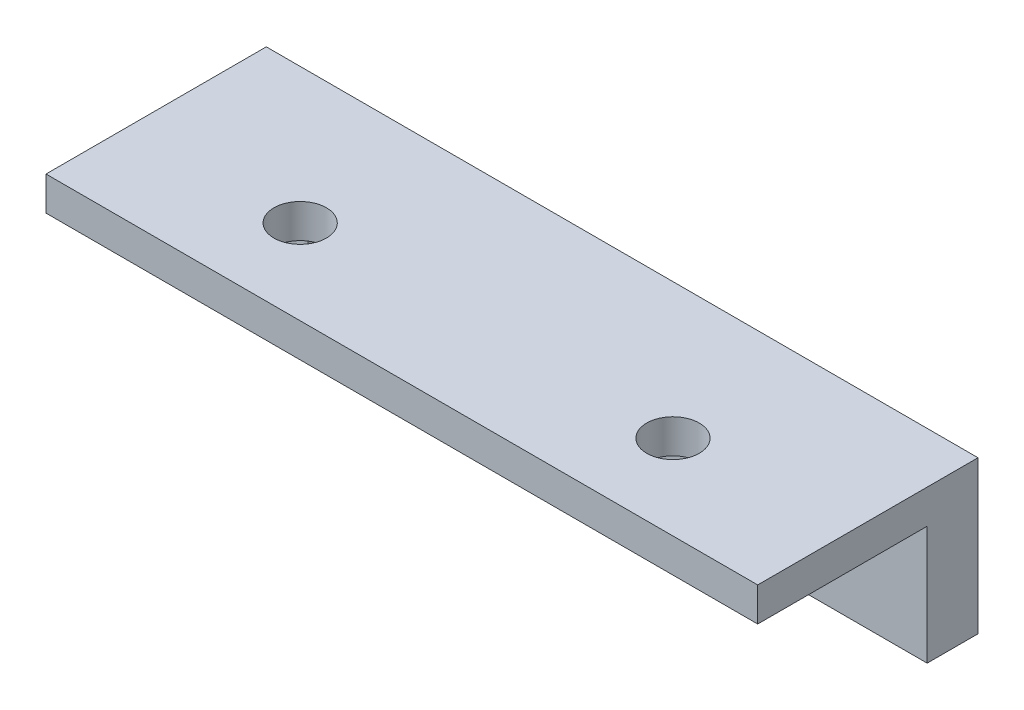
ISO-10303-21;
HEADER;
FILE_DESCRIPTION(('STEP AP214'),'2;1');
FILE_NAME('part.step','',(''),(''),'','','');
FILE_SCHEMA(('AUTOMOTIVE_DESIGN { 1 0 10303 214 1 1 1 1 }'));
ENDSEC;
DATA;
#1=APPLICATION_CONTEXT('core data for automotive mechanical design processes');
#2=APPLICATION_PROTOCOL_DEFINITION('international standard','automotive_design',2000,#1);
#3=PRODUCT_CONTEXT('',#1,'mechanical');
#4=PRODUCT('Part','Part','',(#3));
#5=PRODUCT_RELATED_PRODUCT_CATEGORY('part','',(#4));
#6=PRODUCT_DEFINITION_FORMATION('','',#4);
#7=PRODUCT_DEFINITION_CONTEXT('part definition',#1,'design');
#8=PRODUCT_DEFINITION('design','',#6,#7);
#9=PRODUCT_DEFINITION_SHAPE('','',#8);
#10=(LENGTH_UNIT() NAMED_UNIT(*) SI_UNIT(.MILLI.,.METRE.));
#11=(NAMED_UNIT(*) PLANE_ANGLE_UNIT() SI_UNIT($,.RADIAN.));
#12=(NAMED_UNIT(*) SI_UNIT($,.STERADIAN.) SOLID_ANGLE_UNIT());
#13=UNCERTAINTY_MEASURE_WITH_UNIT(LENGTH_MEASURE(1.E-05),#10,'distance_accuracy_value','');
#14=(GEOMETRIC_REPRESENTATION_CONTEXT(3) GLOBAL_UNCERTAINTY_ASSIGNED_CONTEXT((#13)) GLOBAL_UNIT_ASSIGNED_CONTEXT((#10,
#11,#12)) REPRESENTATION_CONTEXT('',''));
#15=CARTESIAN_POINT('',(0.,0.,0.));
#16=DIRECTION('',(0.,0.,1.));
#17=DIRECTION('',(1.,0.,0.));
#18=AXIS2_PLACEMENT_3D('',#15,#16,#17);
#19=CARTESIAN_POINT('',(0.,5.,3.));
#20=DIRECTION('',(0.,1.,0.));
#21=DIRECTION('',(0.,0.,1.));
#22=AXIS2_PLACEMENT_3D('',#19,#20,#21);
#23=PLANE('',#22);
#24=DIRECTION('',(1.,0.,0.));
#25=VECTOR('',#24,1.);
#26=CARTESIAN_POINT('',(0.,5.,0.));
#27=LINE('',#26,#25);
#28=CARTESIAN_POINT('',(5.,5.,0.));
#29=VERTEX_POINT('',#28);
#30=CARTESIAN_POINT('',(47.,5.,0.));
#31=VERTEX_POINT('',#30);
#32=EDGE_CURVE('E99',#29,#31,#27,.T.);
#33=ORIENTED_EDGE('',*,*,#32,.T.);
#34=DIRECTION('',(0.,0.,-1.));
#35=VECTOR('',#34,1.);
#36=CARTESIAN_POINT('',(47.,5.,3.));
#37=LINE('',#36,#35);
#38=CARTESIAN_POINT('',(47.,5.,3.));
#39=VERTEX_POINT('',#38);
#40=EDGE_CURVE('E11',#39,#31,#37,.T.);
#41=ORIENTED_EDGE('',*,*,#40,.F.);
#42=DIRECTION('',(1.,0.,0.));
#43=VECTOR('',#42,1.);
#44=CARTESIAN_POINT('',(0.,5.,3.));
#45=LINE('',#44,#43);
#46=CARTESIAN_POINT('',(5.,5.,3.));
#47=VERTEX_POINT('',#46);
#48=EDGE_CURVE('E91',#47,#39,#45,.T.);
#49=ORIENTED_EDGE('',*,*,#48,.F.);
#50=DIRECTION('',(0.,0.,-1.));
#51=VECTOR('',#50,1.);
#52=CARTESIAN_POINT('',(5.,5.,3.));
#53=LINE('',#52,#51);
#54=EDGE_CURVE('E47',#47,#29,#53,.T.);
#55=ORIENTED_EDGE('',*,*,#54,.T.);
#56=EDGE_LOOP('',(#33,#41,#49,#55));
#57=FACE_BOUND('',#56,.T.);
#58=ADVANCED_FACE('F38',(#57),#23,.F.);
#59=CARTESIAN_POINT('',(47.,0.,3.));
#60=DIRECTION('',(-1.,0.,0.));
#61=DIRECTION('',(0.,-1.,0.));
#62=AXIS2_PLACEMENT_3D('',#59,#60,#61);
#63=PLANE('',#62);
#64=DIRECTION('',(0.,1.,0.));
#65=VECTOR('',#64,1.);
#66=CARTESIAN_POINT('',(47.,0.,0.));
#67=LINE('',#66,#65);
#68=CARTESIAN_POINT('',(47.,14.,0.));
#69=VERTEX_POINT('',#68);
#70=EDGE_CURVE('E67',#31,#69,#67,.T.);
#71=ORIENTED_EDGE('',*,*,#70,.T.);
#72=DIRECTION('',(0.,0.,-1.));
#73=VECTOR('',#72,1.);
#74=CARTESIAN_POINT('',(47.,14.,13.));
#75=LINE('',#74,#73);
#76=CARTESIAN_POINT('',(47.,14.,13.));
#77=VERTEX_POINT('',#76);
#78=EDGE_CURVE('E117',#77,#69,#75,.T.);
#79=ORIENTED_EDGE('',*,*,#78,.F.);
#80=DIRECTION('',(0.,1.,0.));
#81=VECTOR('',#80,1.);
#82=CARTESIAN_POINT('',(47.,0.,13.));
#83=LINE('',#82,#81);
#84=CARTESIAN_POINT('',(47.,12.,13.));
#85=VERTEX_POINT('',#84);
#86=EDGE_CURVE('E250',#85,#77,#83,.T.);
#87=ORIENTED_EDGE('',*,*,#86,.F.);
#88=DIRECTION('',(0.,0.,-1.));
#89=VECTOR('',#88,1.);
#90=CARTESIAN_POINT('',(47.,12.,13.));
#91=LINE('',#90,#89);
#92=CARTESIAN_POINT('',(47.,12.,3.));
#93=VERTEX_POINT('',#92);
#94=EDGE_CURVE('E89',#85,#93,#91,.T.);
#95=ORIENTED_EDGE('',*,*,#94,.T.);
#96=DIRECTION('',(0.,1.,0.));
#97=VECTOR('',#96,1.);
#98=CARTESIAN_POINT('',(47.,0.,3.));
#99=LINE('',#98,#97);
#100=EDGE_CURVE('E74',#39,#93,#99,.T.);
#101=ORIENTED_EDGE('',*,*,#100,.F.);
#102=ORIENTED_EDGE('',*,*,#40,.T.);
#103=EDGE_LOOP('',(#71,#79,#87,#95,#101,#102));
#104=FACE_BOUND('',#103,.T.);
#105=ADVANCED_FACE('F84',(#104),#63,.F.);
#106=CARTESIAN_POINT('',(40.,8.4,3.));
#107=DIRECTION('',(0.,0.,-1.));
#108=DIRECTION('',(-1.,0.,0.));
#109=AXIS2_PLACEMENT_3D('',#106,#107,#108);
#110=CYLINDRICAL_SURFACE('',#109,1.55);
#111=CARTESIAN_POINT('',(40.,8.4,3.));
#112=DIRECTION('',(0.,0.,1.));
#113=DIRECTION('',(1.,0.,0.));
#114=AXIS2_PLACEMENT_3D('',#111,#112,#113);
#115=CIRCLE('',#114,1.55);
#116=CARTESIAN_POINT('',(41.55,8.4,3.));
#117=VERTEX_POINT('',#116);
#118=EDGE_CURVE('E97',#117,#117,#115,.T.);
#119=ORIENTED_EDGE('',*,*,#118,.T.);
#120=EDGE_LOOP('',(#119));
#121=FACE_BOUND('',#120,.T.);
#122=CARTESIAN_POINT('',(40.,8.4,0.));
#123=DIRECTION('',(0.,0.,1.));
#124=DIRECTION('',(1.,0.,0.));
#125=AXIS2_PLACEMENT_3D('',#122,#123,#124);
#126=CIRCLE('',#125,1.55);
#127=CARTESIAN_POINT('',(41.55,8.4,0.));
#128=VERTEX_POINT('',#127);
#129=EDGE_CURVE('E101',#128,#128,#126,.T.);
#130=ORIENTED_EDGE('',*,*,#129,.F.);
#131=EDGE_LOOP('',(#130));
#132=FACE_BOUND('',#131,.T.);
#133=ADVANCED_FACE('F129',(#121,#132),#110,.F.);
#134=CARTESIAN_POINT('',(12.,8.4,3.));
#135=DIRECTION('',(0.,0.,-1.));
#136=DIRECTION('',(-1.,0.,0.));
#137=AXIS2_PLACEMENT_3D('',#134,#135,#136);
#138=CYLINDRICAL_SURFACE('',#137,1.55);
#139=CARTESIAN_POINT('',(12.,8.4,3.));
#140=DIRECTION('',(0.,0.,1.));
#141=DIRECTION('',(1.,0.,0.));
#142=AXIS2_PLACEMENT_3D('',#139,#140,#141);
#143=CIRCLE('',#142,1.55);
#144=CARTESIAN_POINT('',(13.55,8.4,3.));
#145=VERTEX_POINT('',#144);
#146=EDGE_CURVE('E110',#145,#145,#143,.T.);
#147=ORIENTED_EDGE('',*,*,#146,.T.);
#148=EDGE_LOOP('',(#147));
#149=FACE_BOUND('',#148,.T.);
#150=CARTESIAN_POINT('',(12.,8.4,0.));
#151=DIRECTION('',(0.,0.,1.));
#152=DIRECTION('',(1.,0.,0.));
#153=AXIS2_PLACEMENT_3D('',#150,#151,#152);
#154=CIRCLE('',#153,1.55);
#155=CARTESIAN_POINT('',(13.55,8.4,0.));
#156=VERTEX_POINT('',#155);
#157=EDGE_CURVE('E106',#156,#156,#154,.T.);
#158=ORIENTED_EDGE('',*,*,#157,.F.);
#159=EDGE_LOOP('',(#158));
#160=FACE_BOUND('',#159,.T.);
#161=ADVANCED_FACE('F40',(#149,#160),#138,.F.);
#162=CARTESIAN_POINT('',(5.,0.,3.));
#163=DIRECTION('',(-1.,0.,0.));
#164=DIRECTION('',(0.,-1.,0.));
#165=AXIS2_PLACEMENT_3D('',#162,#163,#164);
#166=PLANE('',#165);
#167=DIRECTION('',(0.,1.,0.));
#168=VECTOR('',#167,1.);
#169=CARTESIAN_POINT('',(5.,0.,0.));
#170=LINE('',#169,#168);
#171=CARTESIAN_POINT('',(5.,14.,0.));
#172=VERTEX_POINT('',#171);
#173=EDGE_CURVE('E103',#29,#172,#170,.T.);
#174=ORIENTED_EDGE('',*,*,#173,.F.);
#175=ORIENTED_EDGE('',*,*,#54,.F.);
#176=DIRECTION('',(0.,1.,0.));
#177=VECTOR('',#176,1.);
#178=CARTESIAN_POINT('',(5.,0.,3.));
#179=LINE('',#178,#177);
#180=CARTESIAN_POINT('',(5.,12.,3.));
#181=VERTEX_POINT('',#180);
#182=EDGE_CURVE('E95',#47,#181,#179,.T.);
#183=ORIENTED_EDGE('',*,*,#182,.T.);
#184=DIRECTION('',(0.,0.,-1.));
#185=VECTOR('',#184,1.);
#186=CARTESIAN_POINT('',(5.,12.,13.));
#187=LINE('',#186,#185);
#188=CARTESIAN_POINT('',(5.,12.,13.));
#189=VERTEX_POINT('',#188);
#190=EDGE_CURVE('E258',#189,#181,#187,.T.);
#191=ORIENTED_EDGE('',*,*,#190,.F.);
#192=DIRECTION('',(0.,1.,0.));
#193=VECTOR('',#192,1.);
#194=CARTESIAN_POINT('',(5.,0.,13.));
#195=LINE('',#194,#193);
#196=CARTESIAN_POINT('',(5.,14.,13.));
#197=VERTEX_POINT('',#196);
#198=EDGE_CURVE('E256',#189,#197,#195,.T.);
#199=ORIENTED_EDGE('',*,*,#198,.T.);
#200=DIRECTION('',(0.,0.,-1.));
#201=VECTOR('',#200,1.);
#202=CARTESIAN_POINT('',(5.,14.,13.));
#203=LINE('',#202,#201);
#204=EDGE_CURVE('E120',#197,#172,#203,.T.);
#205=ORIENTED_EDGE('',*,*,#204,.T.);
#206=EDGE_LOOP('',(#174,#175,#183,#191,#199,#205));
#207=FACE_BOUND('',#206,.T.);
#208=ADVANCED_FACE('F134',(#207),#166,.T.);
#209=CARTESIAN_POINT('',(0.,0.,3.));
#210=DIRECTION('',(0.,0.,1.));
#211=DIRECTION('',(1.,0.,0.));
#212=AXIS2_PLACEMENT_3D('',#209,#210,#211);
#213=PLANE('',#212);
#214=ORIENTED_EDGE('',*,*,#146,.F.);
#215=EDGE_LOOP('',(#214));
#216=FACE_BOUND('',#215,.T.);
#217=ORIENTED_EDGE('',*,*,#118,.F.);
#218=EDGE_LOOP('',(#217));
#219=FACE_BOUND('',#218,.T.);
#220=ORIENTED_EDGE('',*,*,#48,.T.);
#221=ORIENTED_EDGE('',*,*,#100,.T.);
#222=DIRECTION('',(1.,0.,0.));
#223=VECTOR('',#222,1.);
#224=CARTESIAN_POINT('',(0.,12.,3.));
#225=LINE('',#224,#223);
#226=EDGE_CURVE('E90',#181,#93,#225,.T.);
#227=ORIENTED_EDGE('',*,*,#226,.F.);
#228=ORIENTED_EDGE('',*,*,#182,.F.);
#229=EDGE_LOOP('',(#220,#221,#227,#228));
#230=FACE_BOUND('',#229,.T.);
#231=ADVANCED_FACE('F94',(#216,#219,#230),#213,.T.);
#232=CARTESIAN_POINT('',(0.,0.,0.));
#233=DIRECTION('',(0.,0.,1.));
#234=DIRECTION('',(1.,0.,0.));
#235=AXIS2_PLACEMENT_3D('',#232,#233,#234);
#236=PLANE('',#235);
#237=ORIENTED_EDGE('',*,*,#157,.T.);
#238=EDGE_LOOP('',(#237));
#239=FACE_BOUND('',#238,.T.);
#240=ORIENTED_EDGE('',*,*,#129,.T.);
#241=EDGE_LOOP('',(#240));
#242=FACE_BOUND('',#241,.T.);
#243=ORIENTED_EDGE('',*,*,#32,.F.);
#244=ORIENTED_EDGE('',*,*,#173,.T.);
#245=DIRECTION('',(1.,0.,0.));
#246=VECTOR('',#245,1.);
#247=CARTESIAN_POINT('',(0.,14.,0.));
#248=LINE('',#247,#246);
#249=EDGE_CURVE('E239',#172,#69,#248,.T.);
#250=ORIENTED_EDGE('',*,*,#249,.T.);
#251=ORIENTED_EDGE('',*,*,#70,.F.);
#252=EDGE_LOOP('',(#243,#244,#250,#251));
#253=FACE_BOUND('',#252,.T.);
#254=ADVANCED_FACE('F133',(#239,#242,#253),#236,.F.);
#255=CARTESIAN_POINT('',(0.,12.,13.));
#256=DIRECTION('',(0.,1.,0.));
#257=DIRECTION('',(0.,0.,1.));
#258=AXIS2_PLACEMENT_3D('',#255,#256,#257);
#259=PLANE('',#258);
#260=CARTESIAN_POINT('',(15.,12.,8.));
#261=DIRECTION('',(0.,1.,0.));
#262=DIRECTION('',(0.,0.,1.));
#263=AXIS2_PLACEMENT_3D('',#260,#261,#262);
#264=CIRCLE('',#263,1.55);
#265=CARTESIAN_POINT('',(15.,12.,9.55));
#266=VERTEX_POINT('',#265);
#267=EDGE_CURVE('E238',#266,#266,#264,.T.);
#268=ORIENTED_EDGE('',*,*,#267,.T.);
#269=EDGE_LOOP('',(#268));
#270=FACE_BOUND('',#269,.T.);
#271=CARTESIAN_POINT('',(37.,12.,8.));
#272=DIRECTION('',(0.,1.,0.));
#273=DIRECTION('',(0.,0.,1.));
#274=AXIS2_PLACEMENT_3D('',#271,#272,#273);
#275=CIRCLE('',#274,1.55);
#276=CARTESIAN_POINT('',(37.,12.,9.55));
#277=VERTEX_POINT('',#276);
#278=EDGE_CURVE('E240',#277,#277,#275,.T.);
#279=ORIENTED_EDGE('',*,*,#278,.T.);
#280=EDGE_LOOP('',(#279));
#281=FACE_BOUND('',#280,.T.);
#282=ORIENTED_EDGE('',*,*,#190,.T.);
#283=ORIENTED_EDGE('',*,*,#226,.T.);
#284=ORIENTED_EDGE('',*,*,#94,.F.);
#285=DIRECTION('',(1.,0.,0.));
#286=VECTOR('',#285,1.);
#287=CARTESIAN_POINT('',(0.,12.,13.));
#288=LINE('',#287,#286);
#289=EDGE_CURVE('E242',#189,#85,#288,.T.);
#290=ORIENTED_EDGE('',*,*,#289,.F.);
#291=EDGE_LOOP('',(#282,#283,#284,#290));
#292=FACE_BOUND('',#291,.T.);
#293=ADVANCED_FACE('F141',(#270,#281,#292),#259,.F.);
#294=CARTESIAN_POINT('',(0.,14.,13.));
#295=DIRECTION('',(0.,1.,0.));
#296=DIRECTION('',(0.,0.,1.));
#297=AXIS2_PLACEMENT_3D('',#294,#295,#296);
#298=PLANE('',#297);
#299=CARTESIAN_POINT('',(15.,14.,8.));
#300=DIRECTION('',(0.,1.,0.));
#301=DIRECTION('',(0.,0.,1.));
#302=AXIS2_PLACEMENT_3D('',#299,#300,#301);
#303=CIRCLE('',#302,1.55);
#304=CARTESIAN_POINT('',(15.,14.,9.55));
#305=VERTEX_POINT('',#304);
#306=EDGE_CURVE('E235',#305,#305,#303,.T.);
#307=ORIENTED_EDGE('',*,*,#306,.F.);
#308=EDGE_LOOP('',(#307));
#309=FACE_BOUND('',#308,.T.);
#310=CARTESIAN_POINT('',(37.,14.,8.));
#311=DIRECTION('',(0.,1.,0.));
#312=DIRECTION('',(0.,0.,1.));
#313=AXIS2_PLACEMENT_3D('',#310,#311,#312);
#314=CIRCLE('',#313,1.55);
#315=CARTESIAN_POINT('',(37.,14.,9.55));
#316=VERTEX_POINT('',#315);
#317=EDGE_CURVE('E275',#316,#316,#314,.T.);
#318=ORIENTED_EDGE('',*,*,#317,.F.);
#319=EDGE_LOOP('',(#318));
#320=FACE_BOUND('',#319,.T.);
#321=ORIENTED_EDGE('',*,*,#249,.F.);
#322=ORIENTED_EDGE('',*,*,#204,.F.);
#323=DIRECTION('',(1.,0.,0.));
#324=VECTOR('',#323,1.);
#325=CARTESIAN_POINT('',(0.,14.,13.));
#326=LINE('',#325,#324);
#327=EDGE_CURVE('E253',#197,#77,#326,.T.);
#328=ORIENTED_EDGE('',*,*,#327,.T.);
#329=ORIENTED_EDGE('',*,*,#78,.T.);
#330=EDGE_LOOP('',(#321,#322,#328,#329));
#331=FACE_BOUND('',#330,.T.);
#332=ADVANCED_FACE('F192',(#309,#320,#331),#298,.T.);
#333=CARTESIAN_POINT('',(0.,0.,13.));
#334=DIRECTION('',(0.,0.,1.));
#335=DIRECTION('',(1.,0.,0.));
#336=AXIS2_PLACEMENT_3D('',#333,#334,#335);
#337=PLANE('',#336);
#338=ORIENTED_EDGE('',*,*,#289,.T.);
#339=ORIENTED_EDGE('',*,*,#86,.T.);
#340=ORIENTED_EDGE('',*,*,#327,.F.);
#341=ORIENTED_EDGE('',*,*,#198,.F.);
#342=EDGE_LOOP('',(#338,#339,#340,#341));
#343=FACE_BOUND('',#342,.T.);
#344=ADVANCED_FACE('F186',(#343),#337,.T.);
#345=CARTESIAN_POINT('',(37.,0.999999999999999,8.));
#346=DIRECTION('',(0.,1.,0.));
#347=DIRECTION('',(0.,0.,1.));
#348=AXIS2_PLACEMENT_3D('',#345,#346,#347);
#349=CYLINDRICAL_SURFACE('',#348,1.55);
#350=ORIENTED_EDGE('',*,*,#317,.T.);
#351=EDGE_LOOP('',(#350));
#352=FACE_BOUND('',#351,.T.);
#353=ORIENTED_EDGE('',*,*,#278,.F.);
#354=EDGE_LOOP('',(#353));
#355=FACE_BOUND('',#354,.T.);
#356=ADVANCED_FACE('F191',(#352,#355),#349,.F.);
#357=CARTESIAN_POINT('',(15.,0.999999999999999,8.));
#358=DIRECTION('',(0.,1.,0.));
#359=DIRECTION('',(0.,0.,1.));
#360=AXIS2_PLACEMENT_3D('',#357,#358,#359);
#361=CYLINDRICAL_SURFACE('',#360,1.55);
#362=ORIENTED_EDGE('',*,*,#306,.T.);
#363=EDGE_LOOP('',(#362));
#364=FACE_BOUND('',#363,.T.);
#365=ORIENTED_EDGE('',*,*,#267,.F.);
#366=EDGE_LOOP('',(#365));
#367=FACE_BOUND('',#366,.T.);
#368=ADVANCED_FACE('F218',(#364,#367),#361,.F.);
#369=CLOSED_SHELL('',(#58,#105,#133,#161,#208,#231,#254,#293,#332,#344,#356,#368));
#370=MANIFOLD_SOLID_BREP('B2',#369);
#371=ADVANCED_BREP_SHAPE_REPRESENTATION('',(#18,#370),#14);
#372=SHAPE_DEFINITION_REPRESENTATION(#9,#371);
ENDSEC;
END-ISO-10303-21;
